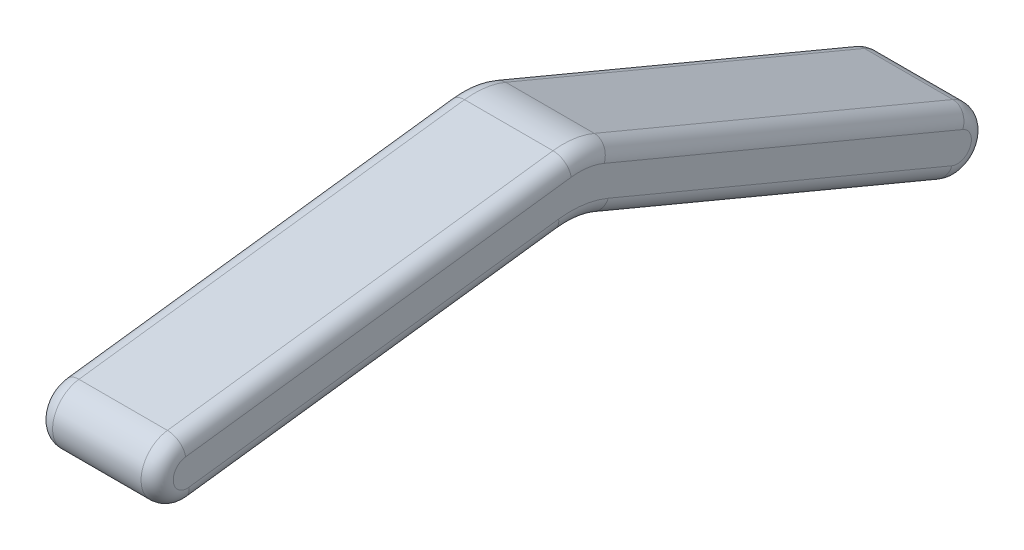
ISO-10303-21;
HEADER;
FILE_DESCRIPTION(('STEP AP214'),'2;1');
FILE_NAME('part.step','',(''),(''),'','','');
FILE_SCHEMA(('AUTOMOTIVE_DESIGN { 1 0 10303 214 1 1 1 1 }'));
ENDSEC;
DATA;
#1=APPLICATION_CONTEXT('core data for automotive mechanical design processes');
#2=APPLICATION_PROTOCOL_DEFINITION('international standard','automotive_design',2000,#1);
#3=PRODUCT_CONTEXT('',#1,'mechanical');
#4=PRODUCT('Part','Part','',(#3));
#5=PRODUCT_RELATED_PRODUCT_CATEGORY('part','',(#4));
#6=PRODUCT_DEFINITION_FORMATION('','',#4);
#7=PRODUCT_DEFINITION_CONTEXT('part definition',#1,'design');
#8=PRODUCT_DEFINITION('design','',#6,#7);
#9=PRODUCT_DEFINITION_SHAPE('','',#8);
#10=(LENGTH_UNIT() NAMED_UNIT(*) SI_UNIT(.MILLI.,.METRE.));
#11=(NAMED_UNIT(*) PLANE_ANGLE_UNIT() SI_UNIT($,.RADIAN.));
#12=(NAMED_UNIT(*) SI_UNIT($,.STERADIAN.) SOLID_ANGLE_UNIT());
#13=UNCERTAINTY_MEASURE_WITH_UNIT(LENGTH_MEASURE(1.E-05),#10,'distance_accuracy_value','');
#14=(GEOMETRIC_REPRESENTATION_CONTEXT(3) GLOBAL_UNCERTAINTY_ASSIGNED_CONTEXT((#13)) GLOBAL_UNIT_ASSIGNED_CONTEXT((#10,
#11,#12)) REPRESENTATION_CONTEXT('',''));
#15=CARTESIAN_POINT('',(0.,0.,0.));
#16=DIRECTION('',(0.,0.,1.));
#17=DIRECTION('',(1.,0.,0.));
#18=AXIS2_PLACEMENT_3D('',#15,#16,#17);
#19=CARTESIAN_POINT('',(7.5,5.18774565598026,48.0342974570473));
#20=DIRECTION('',(-1.,0.,0.));
#21=DIRECTION('',(0.,0.,1.));
#22=AXIS2_PLACEMENT_3D('',#19,#20,#21);
#23=CYLINDRICAL_SURFACE('',#22,9.99999999999999);
#24=DIRECTION('',(-1.,0.,0.));
#25=VECTOR('',#24,1.);
#26=CARTESIAN_POINT('',(7.5,14.4131959272416,44.175402888329));
#27=LINE('',#26,#25);
#28=CARTESIAN_POINT('',(5.5,14.4131959272416,44.175402888329));
#29=VERTEX_POINT('',#28);
#30=CARTESIAN_POINT('',(-5.5,14.4131959272416,44.175402888329));
#31=VERTEX_POINT('',#30);
#32=EDGE_CURVE('E173',#29,#31,#27,.T.);
#33=ORIENTED_EDGE('',*,*,#32,.F.);
#34=CARTESIAN_POINT('',(5.5,5.18774565598026,48.0342974570473));
#35=DIRECTION('',(1.,0.,0.));
#36=DIRECTION('',(0.,0.,-1.));
#37=AXIS2_PLACEMENT_3D('',#34,#35,#36);
#38=CIRCLE('',#37,9.99999999999999);
#39=CARTESIAN_POINT('',(5.5,15.1066672366018,49.3051218656422));
#40=VERTEX_POINT('',#39);
#41=EDGE_CURVE('E227',#29,#40,#38,.T.);
#42=ORIENTED_EDGE('',*,*,#41,.T.);
#43=DIRECTION('',(-1.,0.,0.));
#44=VECTOR('',#43,1.);
#45=CARTESIAN_POINT('',(7.5,15.1066672366018,49.3051218656422));
#46=LINE('',#45,#44);
#47=CARTESIAN_POINT('',(-5.5,15.1066672366018,49.3051218656422));
#48=VERTEX_POINT('',#47);
#49=EDGE_CURVE('E261',#40,#48,#46,.T.);
#50=ORIENTED_EDGE('',*,*,#49,.T.);
#51=CARTESIAN_POINT('',(-5.5,5.18774565598026,48.0342974570473));
#52=DIRECTION('',(1.,0.,0.));
#53=DIRECTION('',(0.,0.,-1.));
#54=AXIS2_PLACEMENT_3D('',#51,#52,#53);
#55=CIRCLE('',#54,9.99999999999999);
#56=EDGE_CURVE('E224',#48,#31,#55,.F.);
#57=ORIENTED_EDGE('',*,*,#56,.T.);
#58=EDGE_LOOP('',(#33,#42,#50,#57));
#59=FACE_BOUND('',#58,.T.);
#60=ADVANCED_FACE('F35',(#59),#23,.F.);
#61=CARTESIAN_POINT('',(7.5,-3.45954385172302,1.44708546326935));
#62=DIRECTION('',(0.,0.922545027126137,-0.385889456871828));
#63=DIRECTION('',(0.,0.385889456871828,0.922545027126138));
#64=AXIS2_PLACEMENT_3D('',#61,#62,#63);
#65=PLANE('',#64);
#66=DIRECTION('',(-1.,0.,0.));
#67=VECTOR('',#66,1.);
#68=CARTESIAN_POINT('',(7.5,-3.45954385172302,1.44708546326935));
#69=LINE('',#68,#67);
#70=CARTESIAN_POINT('',(5.5,-3.45954385172302,1.44708546326935));
#71=VERTEX_POINT('',#70);
#72=CARTESIAN_POINT('',(-5.5,-3.45954385172302,1.44708546326935));
#73=VERTEX_POINT('',#72);
#74=EDGE_CURVE('E315',#71,#73,#69,.T.);
#75=ORIENTED_EDGE('',*,*,#74,.F.);
#76=DIRECTION('',(0.,-0.385889456871828,-0.922545027126138));
#77=VECTOR('',#76,1.);
#78=CARTESIAN_POINT('',(5.5,14.4131959272416,44.175402888329));
#79=LINE('',#78,#77);
#80=EDGE_CURVE('E221',#71,#29,#79,.F.);
#81=ORIENTED_EDGE('',*,*,#80,.T.);
#82=ORIENTED_EDGE('',*,*,#32,.T.);
#83=DIRECTION('',(0.,-0.385889456871828,-0.922545027126138));
#84=VECTOR('',#83,1.);
#85=CARTESIAN_POINT('',(-5.5,-3.45954385172302,1.44708546326935));
#86=LINE('',#85,#84);
#87=EDGE_CURVE('E218',#31,#73,#86,.T.);
#88=ORIENTED_EDGE('',*,*,#87,.T.);
#89=EDGE_LOOP('',(#75,#81,#82,#88));
#90=FACE_BOUND('',#89,.T.);
#91=ADVANCED_FACE('F354',(#90),#65,.F.);
#92=CARTESIAN_POINT('',(7.5,0.,0.));
#93=DIRECTION('',(-1.,0.,0.));
#94=DIRECTION('',(0.,0.,1.));
#95=AXIS2_PLACEMENT_3D('',#92,#93,#94);
#96=CYLINDRICAL_SURFACE('',#95,3.75);
#97=DIRECTION('',(-1.,0.,0.));
#98=VECTOR('',#97,1.);
#99=CARTESIAN_POINT('',(7.5,3.45954385172302,-1.44708546326936));
#100=LINE('',#99,#98);
#101=CARTESIAN_POINT('',(5.5,3.45954385172302,-1.44708546326936));
#102=VERTEX_POINT('',#101);
#103=CARTESIAN_POINT('',(-5.5,3.45954385172302,-1.44708546326936));
#104=VERTEX_POINT('',#103);
#105=EDGE_CURVE('E312',#102,#104,#100,.T.);
#106=ORIENTED_EDGE('',*,*,#105,.F.);
#107=CARTESIAN_POINT('',(5.5,0.,0.));
#108=DIRECTION('',(1.,0.,0.));
#109=DIRECTION('',(0.,0.,-1.));
#110=AXIS2_PLACEMENT_3D('',#107,#108,#109);
#111=CIRCLE('',#110,3.75);
#112=EDGE_CURVE('E215',#102,#71,#111,.F.);
#113=ORIENTED_EDGE('',*,*,#112,.T.);
#114=ORIENTED_EDGE('',*,*,#74,.T.);
#115=CARTESIAN_POINT('',(-5.5,0.,0.));
#116=DIRECTION('',(1.,0.,0.));
#117=DIRECTION('',(0.,0.,-1.));
#118=AXIS2_PLACEMENT_3D('',#115,#116,#117);
#119=CIRCLE('',#118,3.75);
#120=EDGE_CURVE('E212',#73,#104,#119,.T.);
#121=ORIENTED_EDGE('',*,*,#120,.T.);
#122=EDGE_LOOP('',(#106,#113,#114,#121));
#123=FACE_BOUND('',#122,.T.);
#124=ADVANCED_FACE('F349',(#123),#96,.T.);
#125=CARTESIAN_POINT('',(7.5,3.45954385172302,-1.44708546326935));
#126=DIRECTION('',(0.,-0.922545027126137,0.385889456871828));
#127=DIRECTION('',(0.,-0.385889456871828,-0.922545027126138));
#128=AXIS2_PLACEMENT_3D('',#125,#126,#127);
#129=PLANE('',#128);
#130=DIRECTION('',(-1.,0.,0.));
#131=VECTOR('',#130,1.);
#132=CARTESIAN_POINT('',(7.5,22.1077743932113,43.1351959242888));
#133=LINE('',#132,#131);
#134=CARTESIAN_POINT('',(5.5,22.1077743932113,43.1351959242888));
#135=VERTEX_POINT('',#134);
#136=CARTESIAN_POINT('',(-5.5,22.1077743932113,43.1351959242888));
#137=VERTEX_POINT('',#136);
#138=EDGE_CURVE('E309',#135,#137,#133,.T.);
#139=ORIENTED_EDGE('',*,*,#138,.F.);
#140=DIRECTION('',(0.,0.385889456871828,0.922545027126138));
#141=VECTOR('',#140,1.);
#142=CARTESIAN_POINT('',(5.5,3.45954385172301,-1.44708546326937));
#143=LINE('',#142,#141);
#144=EDGE_CURVE('E209',#135,#102,#143,.F.);
#145=ORIENTED_EDGE('',*,*,#144,.T.);
#146=ORIENTED_EDGE('',*,*,#105,.T.);
#147=DIRECTION('',(0.,0.385889456871828,0.922545027126138));
#148=VECTOR('',#147,1.);
#149=CARTESIAN_POINT('',(-5.5,3.45954385172302,-1.44708546326935));
#150=LINE('',#149,#148);
#151=EDGE_CURVE('E206',#104,#137,#150,.T.);
#152=ORIENTED_EDGE('',*,*,#151,.T.);
#153=EDGE_LOOP('',(#139,#145,#146,#152));
#154=FACE_BOUND('',#153,.T.);
#155=ADVANCED_FACE('F345',(#154),#129,.F.);
#156=CARTESIAN_POINT('',(7.5,12.88232412195,46.9940904930071));
#157=DIRECTION('',(-1.,0.,0.));
#158=DIRECTION('',(0.,0.,1.));
#159=AXIS2_PLACEMENT_3D('',#156,#157,#158);
#160=CYLINDRICAL_SURFACE('',#159,10.);
#161=DIRECTION('',(-1.,0.,0.));
#162=VECTOR('',#161,1.);
#163=CARTESIAN_POINT('',(7.5,22.8012457025715,48.264914901602));
#164=LINE('',#163,#162);
#165=CARTESIAN_POINT('',(5.5,22.8012457025715,48.264914901602));
#166=VERTEX_POINT('',#165);
#167=CARTESIAN_POINT('',(-5.5,22.8012457025715,48.264914901602));
#168=VERTEX_POINT('',#167);
#169=EDGE_CURVE('E302',#166,#168,#164,.T.);
#170=ORIENTED_EDGE('',*,*,#169,.F.);
#171=CARTESIAN_POINT('',(5.5,12.88232412195,46.9940904930071));
#172=DIRECTION('',(1.,0.,0.));
#173=DIRECTION('',(0.,0.,-1.));
#174=AXIS2_PLACEMENT_3D('',#171,#172,#173);
#175=CIRCLE('',#174,10.);
#176=EDGE_CURVE('E203',#166,#135,#175,.F.);
#177=ORIENTED_EDGE('',*,*,#176,.T.);
#178=ORIENTED_EDGE('',*,*,#138,.T.);
#179=CARTESIAN_POINT('',(-5.5,12.88232412195,46.9940904930071));
#180=DIRECTION('',(1.,0.,0.));
#181=DIRECTION('',(0.,0.,-1.));
#182=AXIS2_PLACEMENT_3D('',#179,#180,#181);
#183=CIRCLE('',#182,10.);
#184=EDGE_CURVE('E200',#137,#168,#183,.T.);
#185=ORIENTED_EDGE('',*,*,#184,.T.);
#186=EDGE_LOOP('',(#170,#177,#178,#185));
#187=FACE_BOUND('',#186,.T.);
#188=ADVANCED_FACE('F341',(#187),#160,.T.);
#189=CARTESIAN_POINT('',(7.5,22.8012457025715,48.264914901602));
#190=DIRECTION('',(0.,-0.991892158062153,-0.127082440859488));
#191=DIRECTION('',(0.,0.127082440859488,-0.991892158062153));
#192=AXIS2_PLACEMENT_3D('',#189,#190,#191);
#193=PLANE('',#192);
#194=DIRECTION('',(-1.,0.,0.));
#195=VECTOR('',#194,1.);
#196=CARTESIAN_POINT('',(7.5,16.6599463933501,96.1984184126376));
#197=LINE('',#196,#195);
#198=CARTESIAN_POINT('',(5.5,16.6599463933501,96.1984184126376));
#199=VERTEX_POINT('',#198);
#200=CARTESIAN_POINT('',(-5.5,16.6599463933501,96.1984184126376));
#201=VERTEX_POINT('',#200);
#202=EDGE_CURVE('E298',#199,#201,#197,.T.);
#203=ORIENTED_EDGE('',*,*,#202,.F.);
#204=DIRECTION('',(0.,-0.127082440859488,0.991892158062153));
#205=VECTOR('',#204,1.);
#206=CARTESIAN_POINT('',(5.5,22.8012457025715,48.264914901602));
#207=LINE('',#206,#205);
#208=EDGE_CURVE('E197',#199,#166,#207,.F.);
#209=ORIENTED_EDGE('',*,*,#208,.T.);
#210=ORIENTED_EDGE('',*,*,#169,.T.);
#211=DIRECTION('',(0.,-0.127082440859488,0.991892158062153));
#212=VECTOR('',#211,1.);
#213=CARTESIAN_POINT('',(-5.5,22.8012457025715,48.264914901602));
#214=LINE('',#213,#212);
#215=EDGE_CURVE('E194',#168,#201,#214,.T.);
#216=ORIENTED_EDGE('',*,*,#215,.T.);
#217=EDGE_LOOP('',(#203,#209,#210,#216));
#218=FACE_BOUND('',#217,.T.);
#219=ADVANCED_FACE('F338',(#218),#193,.F.);
#220=CARTESIAN_POINT('',(7.5,12.940350800617,95.7218592594145));
#221=DIRECTION('',(-1.,0.,0.));
#222=DIRECTION('',(0.,0.,1.));
#223=AXIS2_PLACEMENT_3D('',#220,#221,#222);
#224=CYLINDRICAL_SURFACE('',#223,3.75);
#225=DIRECTION('',(-1.,0.,0.));
#226=VECTOR('',#225,1.);
#227=CARTESIAN_POINT('',(7.5,9.22075520788394,95.2453001061914));
#228=LINE('',#227,#226);
#229=CARTESIAN_POINT('',(5.5,9.22075520788394,95.2453001061914));
#230=VERTEX_POINT('',#229);
#231=CARTESIAN_POINT('',(-5.5,9.22075520788394,95.2453001061914));
#232=VERTEX_POINT('',#231);
#233=EDGE_CURVE('E296',#230,#232,#228,.T.);
#234=ORIENTED_EDGE('',*,*,#233,.F.);
#235=CARTESIAN_POINT('',(5.5,12.940350800617,95.7218592594145));
#236=DIRECTION('',(1.,0.,0.));
#237=DIRECTION('',(0.,0.,-1.));
#238=AXIS2_PLACEMENT_3D('',#235,#236,#237);
#239=CIRCLE('',#238,3.75);
#240=EDGE_CURVE('E191',#230,#199,#239,.F.);
#241=ORIENTED_EDGE('',*,*,#240,.T.);
#242=ORIENTED_EDGE('',*,*,#202,.T.);
#243=CARTESIAN_POINT('',(-5.5,12.940350800617,95.7218592594145));
#244=DIRECTION('',(1.,0.,0.));
#245=DIRECTION('',(0.,0.,-1.));
#246=AXIS2_PLACEMENT_3D('',#243,#244,#245);
#247=CIRCLE('',#246,3.75);
#248=EDGE_CURVE('E188',#201,#232,#247,.T.);
#249=ORIENTED_EDGE('',*,*,#248,.T.);
#250=EDGE_LOOP('',(#234,#241,#242,#249));
#251=FACE_BOUND('',#250,.T.);
#252=ADVANCED_FACE('F295',(#251),#224,.T.);
#253=CARTESIAN_POINT('',(7.5,15.1066672366018,49.3051218656422));
#254=DIRECTION('',(0.,0.991892158062153,0.127082440859488));
#255=DIRECTION('',(0.,-0.127082440859488,0.991892158062153));
#256=AXIS2_PLACEMENT_3D('',#253,#254,#255);
#257=PLANE('',#256);
#258=ORIENTED_EDGE('',*,*,#49,.F.);
#259=DIRECTION('',(0.,0.127082440859488,-0.991892158062153));
#260=VECTOR('',#259,1.);
#261=CARTESIAN_POINT('',(5.5,9.22075520788394,95.2453001061915));
#262=LINE('',#261,#260);
#263=EDGE_CURVE('E159',#40,#230,#262,.F.);
#264=ORIENTED_EDGE('',*,*,#263,.T.);
#265=ORIENTED_EDGE('',*,*,#233,.T.);
#266=DIRECTION('',(0.,0.127082440859488,-0.991892158062153));
#267=VECTOR('',#266,1.);
#268=CARTESIAN_POINT('',(-5.5,15.1066672366018,49.3051218656422));
#269=LINE('',#268,#267);
#270=EDGE_CURVE('E179',#232,#48,#269,.T.);
#271=ORIENTED_EDGE('',*,*,#270,.T.);
#272=EDGE_LOOP('',(#258,#264,#265,#271));
#273=FACE_BOUND('',#272,.T.);
#274=ADVANCED_FACE('F299',(#273),#257,.F.);
#275=CARTESIAN_POINT('',(7.5,5.18774565598026,48.0342974570473));
#276=DIRECTION('',(1.,0.,0.));
#277=DIRECTION('',(0.,0.,-1.));
#278=AXIS2_PLACEMENT_3D('',#275,#276,#277);
#279=PLANE('',#278);
#280=CARTESIAN_POINT('',(7.5,12.940350800617,95.7218592594145));
#281=DIRECTION('',(1.,0.,0.));
#282=DIRECTION('',(0.,0.,-1.));
#283=AXIS2_PLACEMENT_3D('',#280,#281,#282);
#284=CIRCLE('',#283,1.75);
#285=CARTESIAN_POINT('',(7.5,14.6761620772258,95.9442535309186));
#286=VERTEX_POINT('',#285);
#287=CARTESIAN_POINT('',(7.5,11.2045395240082,95.4994649879104));
#288=VERTEX_POINT('',#287);
#289=EDGE_CURVE('E178',#286,#288,#284,.T.);
#290=ORIENTED_EDGE('',*,*,#289,.T.);
#291=DIRECTION('',(0.,0.127082440859488,-0.991892158062153));
#292=VECTOR('',#291,1.);
#293=CARTESIAN_POINT('',(7.5,17.0904515527261,49.5592867473612));
#294=LINE('',#293,#292);
#295=CARTESIAN_POINT('',(7.5,17.0904515527261,49.5592867473612));
#296=VERTEX_POINT('',#295);
#297=EDGE_CURVE('E156',#288,#296,#294,.T.);
#298=ORIENTED_EDGE('',*,*,#297,.T.);
#299=CARTESIAN_POINT('',(7.5,5.18774565598026,48.0342974570473));
#300=DIRECTION('',(1.,0.,0.));
#301=DIRECTION('',(0.,0.,-1.));
#302=AXIS2_PLACEMENT_3D('',#299,#300,#301);
#303=CIRCLE('',#302,12.);
#304=CARTESIAN_POINT('',(7.5,16.2582859814939,43.4036239745853));
#305=VERTEX_POINT('',#304);
#306=EDGE_CURVE('E166',#296,#305,#303,.F.);
#307=ORIENTED_EDGE('',*,*,#306,.T.);
#308=DIRECTION('',(0.,-0.385889456871828,-0.922545027126138));
#309=VECTOR('',#308,1.);
#310=CARTESIAN_POINT('',(7.5,-1.61445379747075,0.675306549525682));
#311=LINE('',#310,#309);
#312=CARTESIAN_POINT('',(7.5,-1.61445379747074,0.675306549525699));
#313=VERTEX_POINT('',#312);
#314=EDGE_CURVE('E172',#305,#313,#311,.T.);
#315=ORIENTED_EDGE('',*,*,#314,.T.);
#316=CARTESIAN_POINT('',(7.5,0.,0.));
#317=DIRECTION('',(1.,0.,0.));
#318=DIRECTION('',(0.,0.,-1.));
#319=AXIS2_PLACEMENT_3D('',#316,#317,#318);
#320=CIRCLE('',#319,1.75);
#321=CARTESIAN_POINT('',(7.5,1.61445379747074,-0.675306549525699));
#322=VERTEX_POINT('',#321);
#323=EDGE_CURVE('E321',#313,#322,#320,.T.);
#324=ORIENTED_EDGE('',*,*,#323,.T.);
#325=DIRECTION('',(0.,0.385889456871828,0.922545027126138));
#326=VECTOR('',#325,1.);
#327=CARTESIAN_POINT('',(7.5,20.2626843389591,43.9069748380324));
#328=LINE('',#327,#326);
#329=CARTESIAN_POINT('',(7.5,20.2626843389591,43.9069748380324));
#330=VERTEX_POINT('',#329);
#331=EDGE_CURVE('E324',#322,#330,#328,.T.);
#332=ORIENTED_EDGE('',*,*,#331,.T.);
#333=CARTESIAN_POINT('',(7.5,12.88232412195,46.9940904930071));
#334=DIRECTION('',(1.,0.,0.));
#335=DIRECTION('',(0.,0.,-1.));
#336=AXIS2_PLACEMENT_3D('',#333,#334,#335);
#337=CIRCLE('',#336,8.);
#338=CARTESIAN_POINT('',(7.5,20.8174613864472,48.010750019883));
#339=VERTEX_POINT('',#338);
#340=EDGE_CURVE('E327',#330,#339,#337,.T.);
#341=ORIENTED_EDGE('',*,*,#340,.T.);
#342=DIRECTION('',(0.,-0.127082440859488,0.991892158062153));
#343=VECTOR('',#342,1.);
#344=CARTESIAN_POINT('',(7.5,14.6761620772258,95.9442535309186));
#345=LINE('',#344,#343);
#346=EDGE_CURVE('E183',#339,#286,#345,.T.);
#347=ORIENTED_EDGE('',*,*,#346,.T.);
#348=EDGE_LOOP('',(#290,#298,#307,#315,#324,#332,#341,#347));
#349=FACE_BOUND('',#348,.T.);
#350=ADVANCED_FACE('F175',(#349),#279,.T.);
#351=CARTESIAN_POINT('',(-7.5,5.18774565598026,48.0342974570473));
#352=DIRECTION('',(1.,0.,0.));
#353=DIRECTION('',(0.,0.,-1.));
#354=AXIS2_PLACEMENT_3D('',#351,#352,#353);
#355=PLANE('',#354);
#356=CARTESIAN_POINT('',(-7.5,0.,0.));
#357=DIRECTION('',(1.,0.,0.));
#358=DIRECTION('',(0.,0.,-1.));
#359=AXIS2_PLACEMENT_3D('',#356,#357,#358);
#360=CIRCLE('',#359,1.75);
#361=CARTESIAN_POINT('',(-7.5,1.61445379747074,-0.675306549525699));
#362=VERTEX_POINT('',#361);
#363=CARTESIAN_POINT('',(-7.5,-1.61445379747074,0.675306549525699));
#364=VERTEX_POINT('',#363);
#365=EDGE_CURVE('E44',#362,#364,#360,.F.);
#366=ORIENTED_EDGE('',*,*,#365,.T.);
#367=DIRECTION('',(0.,-0.385889456871828,-0.922545027126138));
#368=VECTOR('',#367,1.);
#369=CARTESIAN_POINT('',(-7.5,16.2582859814939,43.4036239745854));
#370=LINE('',#369,#368);
#371=CARTESIAN_POINT('',(-7.5,16.2582859814939,43.4036239745853));
#372=VERTEX_POINT('',#371);
#373=EDGE_CURVE('E11',#364,#372,#370,.F.);
#374=ORIENTED_EDGE('',*,*,#373,.T.);
#375=CARTESIAN_POINT('',(-7.5,5.18774565598026,48.0342974570473));
#376=DIRECTION('',(1.,0.,0.));
#377=DIRECTION('',(0.,0.,-1.));
#378=AXIS2_PLACEMENT_3D('',#375,#376,#377);
#379=CIRCLE('',#378,12.);
#380=CARTESIAN_POINT('',(-7.5,17.0904515527261,49.5592867473612));
#381=VERTEX_POINT('',#380);
#382=EDGE_CURVE('E230',#372,#381,#379,.T.);
#383=ORIENTED_EDGE('',*,*,#382,.T.);
#384=DIRECTION('',(0.,0.127082440859488,-0.991892158062153));
#385=VECTOR('',#384,1.);
#386=CARTESIAN_POINT('',(-7.5,17.0904515527261,49.5592867473612));
#387=LINE('',#386,#385);
#388=CARTESIAN_POINT('',(-7.5,11.2045395240082,95.4994649879104));
#389=VERTEX_POINT('',#388);
#390=EDGE_CURVE('E233',#381,#389,#387,.F.);
#391=ORIENTED_EDGE('',*,*,#390,.T.);
#392=CARTESIAN_POINT('',(-7.5,12.940350800617,95.7218592594145));
#393=DIRECTION('',(1.,0.,0.));
#394=DIRECTION('',(0.,0.,-1.));
#395=AXIS2_PLACEMENT_3D('',#392,#393,#394);
#396=CIRCLE('',#395,1.75);
#397=CARTESIAN_POINT('',(-7.5,14.6761620772258,95.9442535309186));
#398=VERTEX_POINT('',#397);
#399=EDGE_CURVE('E236',#389,#398,#396,.F.);
#400=ORIENTED_EDGE('',*,*,#399,.T.);
#401=DIRECTION('',(0.,-0.127082440859488,0.991892158062153));
#402=VECTOR('',#401,1.);
#403=CARTESIAN_POINT('',(-7.5,20.5620741059436,50.0040752903694));
#404=LINE('',#403,#402);
#405=CARTESIAN_POINT('',(-7.5,20.8174613864472,48.010750019883));
#406=VERTEX_POINT('',#405);
#407=EDGE_CURVE('E239',#398,#406,#404,.F.);
#408=ORIENTED_EDGE('',*,*,#407,.T.);
#409=CARTESIAN_POINT('',(-7.5,12.88232412195,46.9940904930071));
#410=DIRECTION('',(1.,0.,0.));
#411=DIRECTION('',(0.,0.,-1.));
#412=AXIS2_PLACEMENT_3D('',#409,#410,#411);
#413=CIRCLE('',#412,8.);
#414=CARTESIAN_POINT('',(-7.5,20.2626843389591,43.9069748380324));
#415=VERTEX_POINT('',#414);
#416=EDGE_CURVE('E242',#406,#415,#413,.F.);
#417=ORIENTED_EDGE('',*,*,#416,.T.);
#418=DIRECTION('',(0.,0.385889456871828,0.922545027126138));
#419=VECTOR('',#418,1.);
#420=CARTESIAN_POINT('',(-7.5,19.4871935764354,42.053010875534));
#421=LINE('',#420,#419);
#422=EDGE_CURVE('E245',#415,#362,#421,.F.);
#423=ORIENTED_EDGE('',*,*,#422,.T.);
#424=EDGE_LOOP('',(#366,#374,#383,#391,#400,#408,#417,#423));
#425=FACE_BOUND('',#424,.T.);
#426=ADVANCED_FACE('F283',(#425),#355,.F.);
#427=CARTESIAN_POINT('',(5.5,19.4871935764354,42.053010875534));
#428=DIRECTION('',(0.,-0.385889456871828,-0.922545027126138));
#429=DIRECTION('',(0.,0.922545027126137,-0.385889456871828));
#430=AXIS2_PLACEMENT_3D('',#427,#428,#429);
#431=CYLINDRICAL_SURFACE('',#430,2.);
#432=CARTESIAN_POINT('',(5.5,1.61445379747074,-0.675306549525699));
#433=DIRECTION('',(0.,-0.385889456871828,-0.922545027126137));
#434=DIRECTION('',(0.,0.922545027126138,-0.385889456871828));
#435=AXIS2_PLACEMENT_3D('',#432,#433,#434);
#436=CIRCLE('',#435,2.);
#437=EDGE_CURVE('E257',#102,#322,#436,.T.);
#438=ORIENTED_EDGE('',*,*,#437,.F.);
#439=ORIENTED_EDGE('',*,*,#144,.F.);
#440=CARTESIAN_POINT('',(5.5,20.2626843389591,43.9069748380324));
#441=DIRECTION('',(0.,0.385889456871831,0.922545027126136));
#442=DIRECTION('',(0.,-0.922545027126136,0.385889456871831));
#443=AXIS2_PLACEMENT_3D('',#440,#441,#442);
#444=CIRCLE('',#443,2.);
#445=EDGE_CURVE('E259',#330,#135,#444,.T.);
#446=ORIENTED_EDGE('',*,*,#445,.F.);
#447=ORIENTED_EDGE('',*,*,#331,.F.);
#448=EDGE_LOOP('',(#438,#439,#446,#447));
#449=FACE_BOUND('',#448,.T.);
#450=ADVANCED_FACE('F396',(#449),#431,.T.);
#451=CARTESIAN_POINT('',(5.5,12.88232412195,46.9940904930071));
#452=DIRECTION('',(1.,0.,0.));
#453=DIRECTION('',(0.,0.,-1.));
#454=AXIS2_PLACEMENT_3D('',#451,#452,#453);
#455=TOROIDAL_SURFACE('',#454,8.,2.);
#456=ORIENTED_EDGE('',*,*,#445,.T.);
#457=ORIENTED_EDGE('',*,*,#176,.F.);
#458=CARTESIAN_POINT('',(5.5,20.8174613864472,48.010750019883));
#459=DIRECTION('',(0.,-0.127082440859488,0.991892158062153));
#460=DIRECTION('',(0.,-0.991892158062153,-0.127082440859488));
#461=AXIS2_PLACEMENT_3D('',#458,#459,#460);
#462=CIRCLE('',#461,2.);
#463=EDGE_CURVE('E255',#339,#166,#462,.T.);
#464=ORIENTED_EDGE('',*,*,#463,.F.);
#465=ORIENTED_EDGE('',*,*,#340,.F.);
#466=EDGE_LOOP('',(#456,#457,#464,#465));
#467=FACE_BOUND('',#466,.T.);
#468=ADVANCED_FACE('F392',(#467),#455,.T.);
#469=CARTESIAN_POINT('',(5.5,0.,0.));
#470=DIRECTION('',(1.,0.,0.));
#471=DIRECTION('',(0.,0.,-1.));
#472=AXIS2_PLACEMENT_3D('',#469,#470,#471);
#473=DEGENERATE_TOROIDAL_SURFACE('',#472,1.75,2.,.T.);
#474=ORIENTED_EDGE('',*,*,#437,.T.);
#475=ORIENTED_EDGE('',*,*,#323,.F.);
#476=CARTESIAN_POINT('',(5.5,-1.61445379747074,0.675306549525699));
#477=DIRECTION('',(0.,0.385889456871828,0.922545027126137));
#478=DIRECTION('',(0.,-0.922545027126138,0.385889456871828));
#479=AXIS2_PLACEMENT_3D('',#476,#477,#478);
#480=CIRCLE('',#479,2.);
#481=EDGE_CURVE('E253',#71,#313,#480,.T.);
#482=ORIENTED_EDGE('',*,*,#481,.F.);
#483=ORIENTED_EDGE('',*,*,#112,.F.);
#484=EDGE_LOOP('',(#474,#475,#482,#483));
#485=FACE_BOUND('',#484,.T.);
#486=ADVANCED_FACE('F389',(#485),#473,.T.);
#487=CARTESIAN_POINT('',(5.5,20.5620741059436,50.0040752903694));
#488=DIRECTION('',(0.,0.127082440859488,-0.991892158062153));
#489=DIRECTION('',(0.,0.991892158062153,0.127082440859488));
#490=AXIS2_PLACEMENT_3D('',#487,#488,#489);
#491=CYLINDRICAL_SURFACE('',#490,2.);
#492=ORIENTED_EDGE('',*,*,#463,.T.);
#493=ORIENTED_EDGE('',*,*,#208,.F.);
#494=CARTESIAN_POINT('',(5.5,14.6761620772258,95.9442535309186));
#495=DIRECTION('',(0.,-0.127082440859488,0.991892158062153));
#496=DIRECTION('',(0.,-0.991892158062153,-0.127082440859488));
#497=AXIS2_PLACEMENT_3D('',#494,#495,#496);
#498=CIRCLE('',#497,2.);
#499=EDGE_CURVE('E251',#286,#199,#498,.T.);
#500=ORIENTED_EDGE('',*,*,#499,.F.);
#501=ORIENTED_EDGE('',*,*,#346,.F.);
#502=EDGE_LOOP('',(#492,#493,#500,#501));
#503=FACE_BOUND('',#502,.T.);
#504=ADVANCED_FACE('F335',(#503),#491,.T.);
#505=CARTESIAN_POINT('',(5.5,16.2582859814939,43.4036239745854));
#506=DIRECTION('',(0.,0.385889456871828,0.922545027126138));
#507=DIRECTION('',(0.,-0.922545027126137,0.385889456871828));
#508=AXIS2_PLACEMENT_3D('',#505,#506,#507);
#509=CYLINDRICAL_SURFACE('',#508,2.);
#510=ORIENTED_EDGE('',*,*,#481,.T.);
#511=ORIENTED_EDGE('',*,*,#314,.F.);
#512=CARTESIAN_POINT('',(5.5,16.2582859814939,43.4036239745853));
#513=DIRECTION('',(0.,0.385889456871829,0.922545027126137));
#514=DIRECTION('',(0.,-0.922545027126137,0.385889456871829));
#515=AXIS2_PLACEMENT_3D('',#512,#513,#514);
#516=CIRCLE('',#515,2.);
#517=EDGE_CURVE('E168',#29,#305,#516,.T.);
#518=ORIENTED_EDGE('',*,*,#517,.F.);
#519=ORIENTED_EDGE('',*,*,#80,.F.);
#520=EDGE_LOOP('',(#510,#511,#518,#519));
#521=FACE_BOUND('',#520,.T.);
#522=ADVANCED_FACE('F383',(#521),#509,.T.);
#523=CARTESIAN_POINT('',(5.5,12.940350800617,95.7218592594145));
#524=DIRECTION('',(1.,0.,0.));
#525=DIRECTION('',(0.,0.,-1.));
#526=AXIS2_PLACEMENT_3D('',#523,#524,#525);
#527=DEGENERATE_TOROIDAL_SURFACE('',#526,1.75,2.,.T.);
#528=ORIENTED_EDGE('',*,*,#499,.T.);
#529=ORIENTED_EDGE('',*,*,#240,.F.);
#530=CARTESIAN_POINT('',(5.5,11.2045395240082,95.4994649879104));
#531=DIRECTION('',(0.,0.127082440859488,-0.991892158062153));
#532=DIRECTION('',(0.,0.991892158062153,0.127082440859488));
#533=AXIS2_PLACEMENT_3D('',#530,#531,#532);
#534=CIRCLE('',#533,2.);
#535=EDGE_CURVE('E163',#288,#230,#534,.T.);
#536=ORIENTED_EDGE('',*,*,#535,.F.);
#537=ORIENTED_EDGE('',*,*,#289,.F.);
#538=EDGE_LOOP('',(#528,#529,#536,#537));
#539=FACE_BOUND('',#538,.T.);
#540=ADVANCED_FACE('F333',(#539),#527,.T.);
#541=CARTESIAN_POINT('',(5.5,5.18774565598026,48.0342974570473));
#542=DIRECTION('',(1.,0.,0.));
#543=DIRECTION('',(0.,0.,-1.));
#544=AXIS2_PLACEMENT_3D('',#541,#542,#543);
#545=TOROIDAL_SURFACE('',#544,12.,2.);
#546=ORIENTED_EDGE('',*,*,#517,.T.);
#547=ORIENTED_EDGE('',*,*,#306,.F.);
#548=CARTESIAN_POINT('',(5.5,17.0904515527261,49.5592867473612));
#549=DIRECTION('',(0.,-0.127082440859492,0.991892158062152));
#550=DIRECTION('',(0.,-0.991892158062152,-0.127082440859492));
#551=AXIS2_PLACEMENT_3D('',#548,#549,#550);
#552=CIRCLE('',#551,2.);
#553=EDGE_CURVE('E152',#40,#296,#552,.T.);
#554=ORIENTED_EDGE('',*,*,#553,.F.);
#555=ORIENTED_EDGE('',*,*,#41,.F.);
#556=EDGE_LOOP('',(#546,#547,#554,#555));
#557=FACE_BOUND('',#556,.T.);
#558=ADVANCED_FACE('F167',(#557),#545,.T.);
#559=CARTESIAN_POINT('',(5.5,17.0904515527261,49.5592867473612));
#560=DIRECTION('',(0.,-0.127082440859488,0.991892158062153));
#561=DIRECTION('',(0.,-0.991892158062153,-0.127082440859488));
#562=AXIS2_PLACEMENT_3D('',#559,#560,#561);
#563=CYLINDRICAL_SURFACE('',#562,2.);
#564=ORIENTED_EDGE('',*,*,#535,.T.);
#565=ORIENTED_EDGE('',*,*,#263,.F.);
#566=ORIENTED_EDGE('',*,*,#553,.T.);
#567=ORIENTED_EDGE('',*,*,#297,.F.);
#568=EDGE_LOOP('',(#564,#565,#566,#567));
#569=FACE_BOUND('',#568,.T.);
#570=ADVANCED_FACE('F154',(#569),#563,.T.);
#571=CARTESIAN_POINT('',(-5.5,20.8174613864472,48.010750019883));
#572=DIRECTION('',(0.,-0.127082440859488,0.991892158062153));
#573=DIRECTION('',(0.,-0.991892158062153,-0.127082440859488));
#574=AXIS2_PLACEMENT_3D('',#571,#572,#573);
#575=CYLINDRICAL_SURFACE('',#574,2.);
#576=CARTESIAN_POINT('',(-5.5,20.8174613864472,48.010750019883));
#577=DIRECTION('',(0.,0.127082440859492,-0.991892158062152));
#578=DIRECTION('',(0.,0.991892158062152,0.127082440859492));
#579=AXIS2_PLACEMENT_3D('',#576,#577,#578);
#580=CIRCLE('',#579,2.);
#581=EDGE_CURVE('E271',#406,#168,#580,.T.);
#582=ORIENTED_EDGE('',*,*,#581,.F.);
#583=ORIENTED_EDGE('',*,*,#407,.F.);
#584=CARTESIAN_POINT('',(-5.5,14.6761620772258,95.9442535309186));
#585=DIRECTION('',(0.,-0.127082440859488,0.991892158062153));
#586=DIRECTION('',(0.,-0.991892158062153,-0.127082440859488));
#587=AXIS2_PLACEMENT_3D('',#584,#585,#586);
#588=CIRCLE('',#587,2.);
#589=EDGE_CURVE('E39',#201,#398,#588,.T.);
#590=ORIENTED_EDGE('',*,*,#589,.F.);
#591=ORIENTED_EDGE('',*,*,#215,.F.);
#592=EDGE_LOOP('',(#582,#583,#590,#591));
#593=FACE_BOUND('',#592,.T.);
#594=ADVANCED_FACE('F37',(#593),#575,.T.);
#595=CARTESIAN_POINT('',(-5.5,12.940350800617,95.7218592594145));
#596=DIRECTION('',(1.,0.,0.));
#597=DIRECTION('',(0.,0.,-1.));
#598=AXIS2_PLACEMENT_3D('',#595,#596,#597);
#599=DEGENERATE_TOROIDAL_SURFACE('',#598,1.75,2.,.T.);
#600=ORIENTED_EDGE('',*,*,#589,.T.);
#601=ORIENTED_EDGE('',*,*,#399,.F.);
#602=CARTESIAN_POINT('',(-5.5,11.2045395240082,95.4994649879104));
#603=DIRECTION('',(0.,0.127082440859488,-0.991892158062153));
#604=DIRECTION('',(0.,0.991892158062153,0.127082440859488));
#605=AXIS2_PLACEMENT_3D('',#602,#603,#604);
#606=CIRCLE('',#605,2.);
#607=EDGE_CURVE('E270',#232,#389,#606,.T.);
#608=ORIENTED_EDGE('',*,*,#607,.F.);
#609=ORIENTED_EDGE('',*,*,#248,.F.);
#610=EDGE_LOOP('',(#600,#601,#608,#609));
#611=FACE_BOUND('',#610,.T.);
#612=ADVANCED_FACE('F280',(#611),#599,.T.);
#613=CARTESIAN_POINT('',(-5.5,12.88232412195,46.9940904930071));
#614=DIRECTION('',(1.,0.,0.));
#615=DIRECTION('',(0.,0.,-1.));
#616=AXIS2_PLACEMENT_3D('',#613,#614,#615);
#617=TOROIDAL_SURFACE('',#616,8.,2.);
#618=ORIENTED_EDGE('',*,*,#581,.T.);
#619=ORIENTED_EDGE('',*,*,#184,.F.);
#620=CARTESIAN_POINT('',(-5.5,20.2626843389591,43.9069748380324));
#621=DIRECTION('',(0.,-0.385889456871828,-0.922545027126137));
#622=DIRECTION('',(0.,0.922545027126137,-0.385889456871829));
#623=AXIS2_PLACEMENT_3D('',#620,#621,#622);
#624=CIRCLE('',#623,2.);
#625=EDGE_CURVE('E268',#415,#137,#624,.T.);
#626=ORIENTED_EDGE('',*,*,#625,.F.);
#627=ORIENTED_EDGE('',*,*,#416,.F.);
#628=EDGE_LOOP('',(#618,#619,#626,#627));
#629=FACE_BOUND('',#628,.T.);
#630=ADVANCED_FACE('F343',(#629),#617,.T.);
#631=CARTESIAN_POINT('',(-5.5,17.0904515527261,49.5592867473612));
#632=DIRECTION('',(0.,0.127082440859488,-0.991892158062153));
#633=DIRECTION('',(0.,0.991892158062153,0.127082440859488));
#634=AXIS2_PLACEMENT_3D('',#631,#632,#633);
#635=CYLINDRICAL_SURFACE('',#634,2.);
#636=ORIENTED_EDGE('',*,*,#607,.T.);
#637=ORIENTED_EDGE('',*,*,#390,.F.);
#638=CARTESIAN_POINT('',(-5.5,17.0904515527261,49.5592867473612));
#639=DIRECTION('',(0.,0.127082440859488,-0.991892158062153));
#640=DIRECTION('',(0.,0.991892158062153,0.127082440859488));
#641=AXIS2_PLACEMENT_3D('',#638,#639,#640);
#642=CIRCLE('',#641,2.);
#643=EDGE_CURVE('E266',#48,#381,#642,.T.);
#644=ORIENTED_EDGE('',*,*,#643,.F.);
#645=ORIENTED_EDGE('',*,*,#270,.F.);
#646=EDGE_LOOP('',(#636,#637,#644,#645));
#647=FACE_BOUND('',#646,.T.);
#648=ADVANCED_FACE('F287',(#647),#635,.T.);
#649=CARTESIAN_POINT('',(-5.5,1.61445379747074,-0.675306549525699));
#650=DIRECTION('',(0.,0.385889456871828,0.922545027126138));
#651=DIRECTION('',(0.,-0.922545027126137,0.385889456871828));
#652=AXIS2_PLACEMENT_3D('',#649,#650,#651);
#653=CYLINDRICAL_SURFACE('',#652,2.);
#654=ORIENTED_EDGE('',*,*,#625,.T.);
#655=ORIENTED_EDGE('',*,*,#151,.F.);
#656=CARTESIAN_POINT('',(-5.5,1.61445379747074,-0.675306549525699));
#657=DIRECTION('',(0.,-0.385889456871828,-0.922545027126137));
#658=DIRECTION('',(0.,0.922545027126138,-0.385889456871828));
#659=AXIS2_PLACEMENT_3D('',#656,#657,#658);
#660=CIRCLE('',#659,2.);
#661=EDGE_CURVE('E60',#362,#104,#660,.T.);
#662=ORIENTED_EDGE('',*,*,#661,.F.);
#663=ORIENTED_EDGE('',*,*,#422,.F.);
#664=EDGE_LOOP('',(#654,#655,#662,#663));
#665=FACE_BOUND('',#664,.T.);
#666=ADVANCED_FACE('F347',(#665),#653,.T.);
#667=CARTESIAN_POINT('',(-5.5,5.18774565598026,48.0342974570473));
#668=DIRECTION('',(1.,0.,0.));
#669=DIRECTION('',(0.,0.,-1.));
#670=AXIS2_PLACEMENT_3D('',#667,#668,#669);
#671=TOROIDAL_SURFACE('',#670,12.,2.);
#672=ORIENTED_EDGE('',*,*,#643,.T.);
#673=ORIENTED_EDGE('',*,*,#382,.F.);
#674=CARTESIAN_POINT('',(-5.5,16.2582859814939,43.4036239745853));
#675=DIRECTION('',(0.,-0.385889456871832,-0.922545027126136));
#676=DIRECTION('',(0.,0.922545027126136,-0.385889456871832));
#677=AXIS2_PLACEMENT_3D('',#674,#675,#676);
#678=CIRCLE('',#677,2.);
#679=EDGE_CURVE('E263',#31,#372,#678,.T.);
#680=ORIENTED_EDGE('',*,*,#679,.F.);
#681=ORIENTED_EDGE('',*,*,#56,.F.);
#682=EDGE_LOOP('',(#672,#673,#680,#681));
#683=FACE_BOUND('',#682,.T.);
#684=ADVANCED_FACE('F360',(#683),#671,.T.);
#685=CARTESIAN_POINT('',(-5.5,0.,0.));
#686=DIRECTION('',(1.,0.,0.));
#687=DIRECTION('',(0.,0.,-1.));
#688=AXIS2_PLACEMENT_3D('',#685,#686,#687);
#689=DEGENERATE_TOROIDAL_SURFACE('',#688,1.75,2.,.T.);
#690=ORIENTED_EDGE('',*,*,#661,.T.);
#691=ORIENTED_EDGE('',*,*,#120,.F.);
#692=CARTESIAN_POINT('',(-5.5,-1.61445379747074,0.675306549525699));
#693=DIRECTION('',(0.,0.385889456871828,0.922545027126137));
#694=DIRECTION('',(0.,-0.922545027126138,0.385889456871828));
#695=AXIS2_PLACEMENT_3D('',#692,#693,#694);
#696=CIRCLE('',#695,2.);
#697=EDGE_CURVE('E52',#364,#73,#696,.T.);
#698=ORIENTED_EDGE('',*,*,#697,.F.);
#699=ORIENTED_EDGE('',*,*,#365,.F.);
#700=EDGE_LOOP('',(#690,#691,#698,#699));
#701=FACE_BOUND('',#700,.T.);
#702=ADVANCED_FACE('F351',(#701),#689,.T.);
#703=CARTESIAN_POINT('',(-5.5,-1.61445379747074,0.675306549525699));
#704=DIRECTION('',(0.,-0.385889456871828,-0.922545027126138));
#705=DIRECTION('',(0.,0.922545027126137,-0.385889456871828));
#706=AXIS2_PLACEMENT_3D('',#703,#704,#705);
#707=CYLINDRICAL_SURFACE('',#706,2.);
#708=ORIENTED_EDGE('',*,*,#679,.T.);
#709=ORIENTED_EDGE('',*,*,#373,.F.);
#710=ORIENTED_EDGE('',*,*,#697,.T.);
#711=ORIENTED_EDGE('',*,*,#87,.F.);
#712=EDGE_LOOP('',(#708,#709,#710,#711));
#713=FACE_BOUND('',#712,.T.);
#714=ADVANCED_FACE('F357',(#713),#707,.T.);
#715=CLOSED_SHELL('',(#60,#91,#124,#155,#188,#219,#252,#274,#350,#426,#450,#468,#486,#504,#522,
#540,#558,#570,#594,#612,#630,#648,#666,#684,#702,#714));
#716=MANIFOLD_SOLID_BREP('B2',#715);
#717=ADVANCED_BREP_SHAPE_REPRESENTATION('',(#18,#716),#14);
#718=SHAPE_DEFINITION_REPRESENTATION(#9,#717);
ENDSEC;
END-ISO-10303-21;
